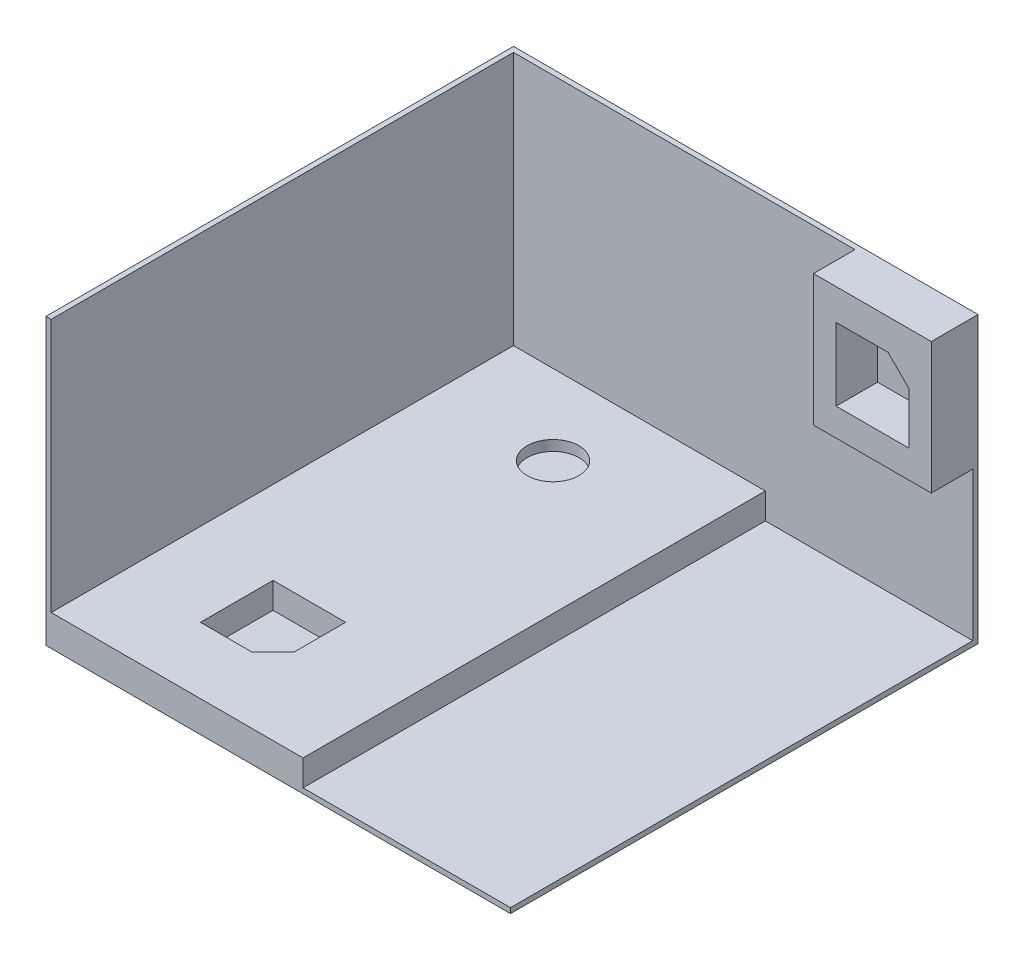
ISO-10303-21;
HEADER;
FILE_DESCRIPTION(('STEP AP214'),'2;1');
FILE_NAME('part.step','',(''),(''),'','','');
FILE_SCHEMA(('AUTOMOTIVE_DESIGN { 1 0 10303 214 1 1 1 1 }'));
ENDSEC;
DATA;
#1=APPLICATION_CONTEXT('core data for automotive mechanical design processes');
#2=APPLICATION_PROTOCOL_DEFINITION('international standard','automotive_design',2000,#1);
#3=PRODUCT_CONTEXT('',#1,'mechanical');
#4=PRODUCT('Part','Part','',(#3));
#5=PRODUCT_RELATED_PRODUCT_CATEGORY('part','',(#4));
#6=PRODUCT_DEFINITION_FORMATION('','',#4);
#7=PRODUCT_DEFINITION_CONTEXT('part definition',#1,'design');
#8=PRODUCT_DEFINITION('design','',#6,#7);
#9=PRODUCT_DEFINITION_SHAPE('','',#8);
#10=(LENGTH_UNIT() NAMED_UNIT(*) SI_UNIT(.MILLI.,.METRE.));
#11=(NAMED_UNIT(*) PLANE_ANGLE_UNIT() SI_UNIT($,.RADIAN.));
#12=(NAMED_UNIT(*) SI_UNIT($,.STERADIAN.) SOLID_ANGLE_UNIT());
#13=UNCERTAINTY_MEASURE_WITH_UNIT(LENGTH_MEASURE(1.E-05),#10,'distance_accuracy_value','');
#14=(GEOMETRIC_REPRESENTATION_CONTEXT(3) GLOBAL_UNCERTAINTY_ASSIGNED_CONTEXT((#13)) GLOBAL_UNIT_ASSIGNED_CONTEXT((#10,
#11,#12)) REPRESENTATION_CONTEXT('',''));
#15=CARTESIAN_POINT('',(0.,0.,0.));
#16=DIRECTION('',(0.,0.,1.));
#17=DIRECTION('',(1.,0.,0.));
#18=AXIS2_PLACEMENT_3D('',#15,#16,#17);
#19=CARTESIAN_POINT('',(0.,762.,-5597.22024855034));
#20=DIRECTION('',(0.,0.,-1.));
#21=DIRECTION('',(-1.,0.,0.));
#22=AXIS2_PLACEMENT_3D('',#19,#20,#21);
#23=PLANE('',#22);
#24=DIRECTION('',(0.,-1.,0.));
#25=VECTOR('',#24,1.);
#26=CARTESIAN_POINT('',(2804.13968,6981.20524,-5597.22024855034));
#27=LINE('',#26,#25);
#28=CARTESIAN_POINT('',(2804.13968,6981.20524,-5597.22024855034));
#29=VERTEX_POINT('',#28);
#30=CARTESIAN_POINT('',(2804.13968,3766.52536,-5597.22024855034));
#31=VERTEX_POINT('',#30);
#32=EDGE_CURVE('E203',#29,#31,#27,.T.);
#33=ORIENTED_EDGE('',*,*,#32,.F.);
#34=DIRECTION('',(1.,0.,0.));
#35=VECTOR('',#34,1.);
#36=CARTESIAN_POINT('',(0.,6981.20524,-5597.22024855034));
#37=LINE('',#36,#35);
#38=CARTESIAN_POINT('',(-5560.79914,6981.20524,-5597.22024855034));
#39=VERTEX_POINT('',#38);
#40=EDGE_CURVE('E266',#39,#29,#37,.T.);
#41=ORIENTED_EDGE('',*,*,#40,.F.);
#42=DIRECTION('',(0.,-1.,0.));
#43=VECTOR('',#42,1.);
#44=CARTESIAN_POINT('',(-5560.79914,6981.20524,-5597.22024855034));
#45=LINE('',#44,#43);
#46=CARTESIAN_POINT('',(-5560.79914,762.,-5597.22024855034));
#47=VERTEX_POINT('',#46);
#48=EDGE_CURVE('E271',#39,#47,#45,.T.);
#49=ORIENTED_EDGE('',*,*,#48,.T.);
#50=DIRECTION('',(-1.,0.,0.));
#51=VECTOR('',#50,1.);
#52=CARTESIAN_POINT('',(0.,762.,-5597.22024855034));
#53=LINE('',#52,#51);
#54=CARTESIAN_POINT('',(607.128580000001,762.,-5597.22024855034));
#55=VERTEX_POINT('',#54);
#56=EDGE_CURVE('E362',#55,#47,#53,.T.);
#57=ORIENTED_EDGE('',*,*,#56,.F.);
#58=DIRECTION('',(0.,-1.,0.));
#59=VECTOR('',#58,1.);
#60=CARTESIAN_POINT('',(607.12858,762.,-5597.22024855034));
#61=LINE('',#60,#59);
#62=CARTESIAN_POINT('',(607.12858,127.,-5597.22024855034));
#63=VERTEX_POINT('',#62);
#64=EDGE_CURVE('E303',#55,#63,#61,.T.);
#65=ORIENTED_EDGE('',*,*,#64,.T.);
#66=DIRECTION('',(-1.,0.,0.));
#67=VECTOR('',#66,1.);
#68=CARTESIAN_POINT('',(0.,127.,-5597.22024855034));
#69=LINE('',#68,#67);
#70=CARTESIAN_POINT('',(5687.79914,127.,-5597.22024855034));
#71=VERTEX_POINT('',#70);
#72=EDGE_CURVE('E323',#71,#63,#69,.T.);
#73=ORIENTED_EDGE('',*,*,#72,.F.);
#74=DIRECTION('',(0.,-1.,0.));
#75=VECTOR('',#74,1.);
#76=CARTESIAN_POINT('',(5687.79914,762.,-5597.22024855034));
#77=LINE('',#76,#75);
#78=CARTESIAN_POINT('',(5687.79914,3766.52536,-5597.22024855034));
#79=VERTEX_POINT('',#78);
#80=EDGE_CURVE('E317',#79,#71,#77,.T.);
#81=ORIENTED_EDGE('',*,*,#80,.F.);
#82=DIRECTION('',(1.,0.,0.));
#83=VECTOR('',#82,1.);
#84=CARTESIAN_POINT('',(5687.79914,3766.52536,-5597.22024855034));
#85=LINE('',#84,#83);
#86=EDGE_CURVE('E239',#31,#79,#85,.T.);
#87=ORIENTED_EDGE('',*,*,#86,.F.);
#88=EDGE_LOOP('',(#33,#41,#49,#57,#65,#73,#81,#87));
#89=FACE_BOUND('',#88,.T.);
#90=ADVANCED_FACE('F37',(#89),#23,.F.);
#91=CARTESIAN_POINT('',(0.,762.,0.));
#92=DIRECTION('',(0.,1.,0.));
#93=DIRECTION('',(0.,0.,1.));
#94=AXIS2_PLACEMENT_3D('',#91,#92,#93);
#95=PLANE('',#94);
#96=CARTESIAN_POINT('',(-2636.77654,762.,-3641.79739));
#97=DIRECTION('',(0.,1.,0.));
#98=DIRECTION('',(0.,0.,1.));
#99=AXIS2_PLACEMENT_3D('',#96,#97,#98);
#100=CIRCLE('',#99,635.);
#101=CARTESIAN_POINT('',(-2636.77654,762.,-3006.79739));
#102=VERTEX_POINT('',#101);
#103=EDGE_CURVE('E282',#102,#102,#100,.T.);
#104=ORIENTED_EDGE('',*,*,#103,.F.);
#105=EDGE_LOOP('',(#104));
#106=FACE_BOUND('',#105,.T.);
#107=DIRECTION('',(1.,0.,0.));
#108=VECTOR('',#107,1.);
#109=CARTESIAN_POINT('',(0.,762.,2327.20261));
#110=LINE('',#109,#108);
#111=CARTESIAN_POINT('',(-3525.77654,762.,2327.20261));
#112=VERTEX_POINT('',#111);
#113=CARTESIAN_POINT('',(-1747.77654,762.,2327.20261));
#114=VERTEX_POINT('',#113);
#115=EDGE_CURVE('E285',#112,#114,#110,.T.);
#116=ORIENTED_EDGE('',*,*,#115,.T.);
#117=DIRECTION('',(0.,0.,1.));
#118=VECTOR('',#117,1.);
#119=CARTESIAN_POINT('',(-1747.77654,762.,0.));
#120=LINE('',#119,#118);
#121=CARTESIAN_POINT('',(-1747.77654,762.,3597.20261));
#122=VERTEX_POINT('',#121);
#123=EDGE_CURVE('E288',#114,#122,#120,.T.);
#124=ORIENTED_EDGE('',*,*,#123,.T.);
#125=DIRECTION('',(-0.707106781186549,0.,0.707106781186547));
#126=VECTOR('',#125,1.);
#127=CARTESIAN_POINT('',(924.713035000003,762.,924.713035000006));
#128=LINE('',#127,#126);
#129=CARTESIAN_POINT('',(-2255.77654,762.,4105.20261));
#130=VERTEX_POINT('',#129);
#131=EDGE_CURVE('E290',#122,#130,#128,.T.);
#132=ORIENTED_EDGE('',*,*,#131,.T.);
#133=DIRECTION('',(1.,0.,0.));
#134=VECTOR('',#133,1.);
#135=CARTESIAN_POINT('',(2.87098611551073E-12,762.,4105.20261));
#136=LINE('',#135,#134);
#137=CARTESIAN_POINT('',(-3525.77654,762.,4105.20261));
#138=VERTEX_POINT('',#137);
#139=EDGE_CURVE('E292',#138,#130,#136,.T.);
#140=ORIENTED_EDGE('',*,*,#139,.F.);
#141=DIRECTION('',(0.,0.,1.));
#142=VECTOR('',#141,1.);
#143=CARTESIAN_POINT('',(-3525.77654,762.,0.));
#144=LINE('',#143,#142);
#145=EDGE_CURVE('E295',#112,#138,#144,.T.);
#146=ORIENTED_EDGE('',*,*,#145,.F.);
#147=EDGE_LOOP('',(#116,#124,#132,#140,#146));
#148=FACE_BOUND('',#147,.T.);
#149=ORIENTED_EDGE('',*,*,#56,.T.);
#150=DIRECTION('',(0.,0.,1.));
#151=VECTOR('',#150,1.);
#152=CARTESIAN_POINT('',(-5560.79914,762.,-4.362182486167E-13));
#153=LINE('',#152,#151);
#154=CARTESIAN_POINT('',(-5560.79914,762.,5725.05205));
#155=VERTEX_POINT('',#154);
#156=EDGE_CURVE('E45',#47,#155,#153,.T.);
#157=ORIENTED_EDGE('',*,*,#156,.T.);
#158=DIRECTION('',(-1.,0.,0.));
#159=VECTOR('',#158,1.);
#160=CARTESIAN_POINT('',(8.93995648810827E-13,762.,5725.05205));
#161=LINE('',#160,#159);
#162=CARTESIAN_POINT('',(607.128580000002,762.,5725.05205));
#163=VERTEX_POINT('',#162);
#164=EDGE_CURVE('E279',#163,#155,#161,.T.);
#165=ORIENTED_EDGE('',*,*,#164,.F.);
#166=DIRECTION('',(0.,0.,1.));
#167=VECTOR('',#166,1.);
#168=CARTESIAN_POINT('',(607.128580000001,762.,-1.17736593927382E-13));
#169=LINE('',#168,#167);
#170=EDGE_CURVE('E276',#55,#163,#169,.T.);
#171=ORIENTED_EDGE('',*,*,#170,.F.);
#172=EDGE_LOOP('',(#149,#157,#165,#171));
#173=FACE_BOUND('',#172,.T.);
#174=ADVANCED_FACE('F367',(#106,#148,#173),#95,.T.);
#175=CARTESIAN_POINT('',(0.,127.,0.));
#176=DIRECTION('',(0.,1.,0.));
#177=DIRECTION('',(0.,0.,1.));
#178=AXIS2_PLACEMENT_3D('',#175,#176,#177);
#179=PLANE('',#178);
#180=DIRECTION('',(0.,0.,-1.));
#181=VECTOR('',#180,1.);
#182=CARTESIAN_POINT('',(607.128580000001,127.,-1.17736593927382E-13));
#183=LINE('',#182,#181);
#184=CARTESIAN_POINT('',(607.128580000002,127.,5725.05205));
#185=VERTEX_POINT('',#184);
#186=EDGE_CURVE('E326',#185,#63,#183,.T.);
#187=ORIENTED_EDGE('',*,*,#186,.F.);
#188=DIRECTION('',(-1.,0.,0.));
#189=VECTOR('',#188,1.);
#190=CARTESIAN_POINT('',(8.93995648810827E-13,127.,5725.05205));
#191=LINE('',#190,#189);
#192=CARTESIAN_POINT('',(5687.79914,127.,5725.05205));
#193=VERTEX_POINT('',#192);
#194=EDGE_CURVE('E337',#193,#185,#191,.T.);
#195=ORIENTED_EDGE('',*,*,#194,.F.);
#196=DIRECTION('',(0.,0.,1.));
#197=VECTOR('',#196,1.);
#198=CARTESIAN_POINT('',(5687.79914,127.,-8.82399043295498E-13));
#199=LINE('',#198,#197);
#200=EDGE_CURVE('E340',#71,#193,#199,.T.);
#201=ORIENTED_EDGE('',*,*,#200,.F.);
#202=ORIENTED_EDGE('',*,*,#72,.T.);
#203=EDGE_LOOP('',(#187,#195,#201,#202));
#204=FACE_BOUND('',#203,.T.);
#205=ADVANCED_FACE('F386',(#204),#179,.T.);
#206=CARTESIAN_POINT('',(-1.34099347321624E-12,127.,-5725.05205));
#207=DIRECTION('',(0.,0.,1.));
#208=DIRECTION('',(1.,0.,0.));
#209=AXIS2_PLACEMENT_3D('',#206,#207,#208);
#210=PLANE('',#209);
#211=DIRECTION('',(-1.,0.,0.));
#212=VECTOR('',#211,1.);
#213=CARTESIAN_POINT('',(-1.34099347321624E-12,0.,-5725.05205));
#214=LINE('',#213,#212);
#215=CARTESIAN_POINT('',(5687.79914,0.,-5725.05205));
#216=VERTEX_POINT('',#215);
#217=CARTESIAN_POINT('',(-5687.79914,0.,-5725.05205));
#218=VERTEX_POINT('',#217);
#219=EDGE_CURVE('E336',#216,#218,#214,.T.);
#220=ORIENTED_EDGE('',*,*,#219,.T.);
#221=DIRECTION('',(0.,-1.,0.));
#222=VECTOR('',#221,1.);
#223=CARTESIAN_POINT('',(-5687.79914,127.,-5725.05205));
#224=LINE('',#223,#222);
#225=CARTESIAN_POINT('',(-5687.79914,6981.20524,-5725.05205));
#226=VERTEX_POINT('',#225);
#227=EDGE_CURVE('E359',#226,#218,#224,.T.);
#228=ORIENTED_EDGE('',*,*,#227,.F.);
#229=DIRECTION('',(-1.,0.,0.));
#230=VECTOR('',#229,1.);
#231=CARTESIAN_POINT('',(-1.34099347321624E-12,6981.20524,-5725.05205));
#232=LINE('',#231,#230);
#233=CARTESIAN_POINT('',(5687.79914,6981.20524,-5725.05205));
#234=VERTEX_POINT('',#233);
#235=EDGE_CURVE('E255',#234,#226,#232,.T.);
#236=ORIENTED_EDGE('',*,*,#235,.F.);
#237=DIRECTION('',(0.,-1.,0.));
#238=VECTOR('',#237,1.);
#239=CARTESIAN_POINT('',(5687.79914,127.,-5725.05205));
#240=LINE('',#239,#238);
#241=EDGE_CURVE('E343',#234,#216,#240,.T.);
#242=ORIENTED_EDGE('',*,*,#241,.T.);
#243=EDGE_LOOP('',(#220,#228,#236,#242));
#244=FACE_BOUND('',#243,.T.);
#245=ADVANCED_FACE('F39',(#244),#210,.F.);
#246=CARTESIAN_POINT('',(-5687.79914,127.,8.82399043295498E-13));
#247=DIRECTION('',(1.,0.,0.));
#248=DIRECTION('',(0.,0.,-1.));
#249=AXIS2_PLACEMENT_3D('',#246,#247,#248);
#250=PLANE('',#249);
#251=DIRECTION('',(0.,0.,1.));
#252=VECTOR('',#251,1.);
#253=CARTESIAN_POINT('',(-5687.79914,0.,8.82399043295498E-13));
#254=LINE('',#253,#252);
#255=CARTESIAN_POINT('',(-5687.79914,0.,5725.05205));
#256=VERTEX_POINT('',#255);
#257=EDGE_CURVE('E346',#218,#256,#254,.T.);
#258=ORIENTED_EDGE('',*,*,#257,.T.);
#259=DIRECTION('',(0.,-1.,0.));
#260=VECTOR('',#259,1.);
#261=CARTESIAN_POINT('',(-5687.79914,127.,5725.05205));
#262=LINE('',#261,#260);
#263=CARTESIAN_POINT('',(-5687.79914,6981.20524,5725.05205));
#264=VERTEX_POINT('',#263);
#265=EDGE_CURVE('E356',#264,#256,#262,.T.);
#266=ORIENTED_EDGE('',*,*,#265,.F.);
#267=DIRECTION('',(0.,0.,1.));
#268=VECTOR('',#267,1.);
#269=CARTESIAN_POINT('',(-5687.79914,6981.20524,8.82399043295498E-13));
#270=LINE('',#269,#268);
#271=EDGE_CURVE('E258',#226,#264,#270,.T.);
#272=ORIENTED_EDGE('',*,*,#271,.F.);
#273=ORIENTED_EDGE('',*,*,#227,.T.);
#274=EDGE_LOOP('',(#258,#266,#272,#273));
#275=FACE_BOUND('',#274,.T.);
#276=ADVANCED_FACE('F667',(#275),#250,.F.);
#277=CARTESIAN_POINT('',(8.93995648810827E-13,127.,5725.05205));
#278=DIRECTION('',(0.,0.,1.));
#279=DIRECTION('',(1.,0.,0.));
#280=AXIS2_PLACEMENT_3D('',#277,#278,#279);
#281=PLANE('',#280);
#282=ORIENTED_EDGE('',*,*,#265,.T.);
#283=DIRECTION('',(-1.,0.,0.));
#284=VECTOR('',#283,1.);
#285=CARTESIAN_POINT('',(8.93995648810827E-13,0.,5725.05205));
#286=LINE('',#285,#284);
#287=CARTESIAN_POINT('',(5687.79914,0.,5725.05205));
#288=VERTEX_POINT('',#287);
#289=EDGE_CURVE('E349',#288,#256,#286,.T.);
#290=ORIENTED_EDGE('',*,*,#289,.F.);
#291=DIRECTION('',(0.,-1.,0.));
#292=VECTOR('',#291,1.);
#293=CARTESIAN_POINT('',(5687.79914,127.,5725.05205));
#294=LINE('',#293,#292);
#295=EDGE_CURVE('E353',#193,#288,#294,.T.);
#296=ORIENTED_EDGE('',*,*,#295,.F.);
#297=ORIENTED_EDGE('',*,*,#194,.T.);
#298=DIRECTION('',(0.,-1.,0.));
#299=VECTOR('',#298,1.);
#300=CARTESIAN_POINT('',(607.128580000002,762.,5725.05205));
#301=LINE('',#300,#299);
#302=EDGE_CURVE('E298',#163,#185,#301,.T.);
#303=ORIENTED_EDGE('',*,*,#302,.F.);
#304=ORIENTED_EDGE('',*,*,#164,.T.);
#305=DIRECTION('',(0.,-1.,0.));
#306=VECTOR('',#305,1.);
#307=CARTESIAN_POINT('',(-5560.79914,6981.20524,5725.05205));
#308=LINE('',#307,#306);
#309=CARTESIAN_POINT('',(-5560.79914,6981.20524,5725.05205));
#310=VERTEX_POINT('',#309);
#311=EDGE_CURVE('E274',#310,#155,#308,.T.);
#312=ORIENTED_EDGE('',*,*,#311,.F.);
#313=DIRECTION('',(-1.,0.,0.));
#314=VECTOR('',#313,1.);
#315=CARTESIAN_POINT('',(8.93995648810827E-13,6981.20524,5725.05205));
#316=LINE('',#315,#314);
#317=EDGE_CURVE('E261',#310,#264,#316,.T.);
#318=ORIENTED_EDGE('',*,*,#317,.T.);
#319=EDGE_LOOP('',(#282,#290,#296,#297,#303,#304,#312,#318));
#320=FACE_BOUND('',#319,.T.);
#321=ADVANCED_FACE('F372',(#320),#281,.T.);
#322=CARTESIAN_POINT('',(5687.79914,127.,-8.82399043295498E-13));
#323=DIRECTION('',(1.,0.,0.));
#324=DIRECTION('',(0.,0.,-1.));
#325=AXIS2_PLACEMENT_3D('',#322,#323,#324);
#326=PLANE('',#325);
#327=DIRECTION('',(0.,0.,1.));
#328=VECTOR('',#327,1.);
#329=CARTESIAN_POINT('',(5687.79914,6981.20524,-8.82399043295498E-13));
#330=LINE('',#329,#328);
#331=CARTESIAN_POINT('',(5687.79914,6981.20524,-4581.22024855034));
#332=VERTEX_POINT('',#331);
#333=EDGE_CURVE('E269',#234,#332,#330,.T.);
#334=ORIENTED_EDGE('',*,*,#333,.T.);
#335=DIRECTION('',(0.,1.,0.));
#336=VECTOR('',#335,1.);
#337=CARTESIAN_POINT('',(5687.79914,6981.20524,-4581.22024855034));
#338=LINE('',#337,#336);
#339=CARTESIAN_POINT('',(5687.79914,3766.52536,-4581.22024855034));
#340=VERTEX_POINT('',#339);
#341=EDGE_CURVE('E235',#340,#332,#338,.T.);
#342=ORIENTED_EDGE('',*,*,#341,.F.);
#343=DIRECTION('',(0.,0.,-1.));
#344=VECTOR('',#343,1.);
#345=CARTESIAN_POINT('',(5687.79914,3766.52536,-4581.22024855034));
#346=LINE('',#345,#344);
#347=EDGE_CURVE('E245',#340,#79,#346,.T.);
#348=ORIENTED_EDGE('',*,*,#347,.T.);
#349=ORIENTED_EDGE('',*,*,#80,.T.);
#350=ORIENTED_EDGE('',*,*,#200,.T.);
#351=ORIENTED_EDGE('',*,*,#295,.T.);
#352=DIRECTION('',(0.,0.,1.));
#353=VECTOR('',#352,1.);
#354=CARTESIAN_POINT('',(5687.79914,0.,-8.82399043295498E-13));
#355=LINE('',#354,#353);
#356=EDGE_CURVE('E341',#216,#288,#355,.T.);
#357=ORIENTED_EDGE('',*,*,#356,.F.);
#358=ORIENTED_EDGE('',*,*,#241,.F.);
#359=EDGE_LOOP('',(#334,#342,#348,#349,#350,#351,#357,#358));
#360=FACE_BOUND('',#359,.T.);
#361=ADVANCED_FACE('F388',(#360),#326,.T.);
#362=CARTESIAN_POINT('',(0.,0.,0.));
#363=DIRECTION('',(0.,1.,0.));
#364=DIRECTION('',(0.,0.,1.));
#365=AXIS2_PLACEMENT_3D('',#362,#363,#364);
#366=PLANE('',#365);
#367=ORIENTED_EDGE('',*,*,#289,.T.);
#368=ORIENTED_EDGE('',*,*,#257,.F.);
#369=ORIENTED_EDGE('',*,*,#219,.F.);
#370=ORIENTED_EDGE('',*,*,#356,.T.);
#371=EDGE_LOOP('',(#367,#368,#369,#370));
#372=FACE_BOUND('',#371,.T.);
#373=ADVANCED_FACE('F392',(#372),#366,.F.);
#374=CARTESIAN_POINT('',(0.,762.,2327.20261));
#375=DIRECTION('',(0.,0.,-1.));
#376=DIRECTION('',(-1.,0.,0.));
#377=AXIS2_PLACEMENT_3D('',#374,#375,#376);
#378=PLANE('',#377);
#379=DIRECTION('',(-1.,0.,0.));
#380=VECTOR('',#379,1.);
#381=CARTESIAN_POINT('',(0.,127.,2327.20261));
#382=LINE('',#381,#380);
#383=CARTESIAN_POINT('',(-1747.77654,127.,2327.20261));
#384=VERTEX_POINT('',#383);
#385=CARTESIAN_POINT('',(-3525.77654,127.,2327.20261));
#386=VERTEX_POINT('',#385);
#387=EDGE_CURVE('E334',#384,#386,#382,.T.);
#388=ORIENTED_EDGE('',*,*,#387,.F.);
#389=DIRECTION('',(0.,-1.,0.));
#390=VECTOR('',#389,1.);
#391=CARTESIAN_POINT('',(-1747.77654,762.,2327.20261));
#392=LINE('',#391,#390);
#393=EDGE_CURVE('E312',#114,#384,#392,.T.);
#394=ORIENTED_EDGE('',*,*,#393,.F.);
#395=ORIENTED_EDGE('',*,*,#115,.F.);
#396=DIRECTION('',(0.,-1.,0.));
#397=VECTOR('',#396,1.);
#398=CARTESIAN_POINT('',(-3525.77654,762.,2327.20261));
#399=LINE('',#398,#397);
#400=EDGE_CURVE('E299',#112,#386,#399,.T.);
#401=ORIENTED_EDGE('',*,*,#400,.T.);
#402=EDGE_LOOP('',(#388,#394,#395,#401));
#403=FACE_BOUND('',#402,.T.);
#404=ADVANCED_FACE('F613',(#403),#378,.F.);
#405=CARTESIAN_POINT('',(-1747.77654,762.,0.));
#406=DIRECTION('',(1.,0.,0.));
#407=DIRECTION('',(0.,0.,-1.));
#408=AXIS2_PLACEMENT_3D('',#405,#406,#407);
#409=PLANE('',#408);
#410=DIRECTION('',(0.,0.,-1.));
#411=VECTOR('',#410,1.);
#412=CARTESIAN_POINT('',(-1747.77654,127.,0.));
#413=LINE('',#412,#411);
#414=CARTESIAN_POINT('',(-1747.77654,127.,3597.20261));
#415=VERTEX_POINT('',#414);
#416=EDGE_CURVE('E60',#415,#384,#413,.T.);
#417=ORIENTED_EDGE('',*,*,#416,.F.);
#418=DIRECTION('',(0.,-1.,0.));
#419=VECTOR('',#418,1.);
#420=CARTESIAN_POINT('',(-1747.77654,762.,3597.20261));
#421=LINE('',#420,#419);
#422=EDGE_CURVE('E309',#122,#415,#421,.T.);
#423=ORIENTED_EDGE('',*,*,#422,.F.);
#424=ORIENTED_EDGE('',*,*,#123,.F.);
#425=ORIENTED_EDGE('',*,*,#393,.T.);
#426=EDGE_LOOP('',(#417,#423,#424,#425));
#427=FACE_BOUND('',#426,.T.);
#428=ADVANCED_FACE('F605',(#427),#409,.F.);
#429=CARTESIAN_POINT('',(924.713035000003,762.,924.713035000006));
#430=DIRECTION('',(0.707106781186547,0.,0.707106781186549));
#431=DIRECTION('',(0.707106781186549,0.,-0.707106781186547));
#432=AXIS2_PLACEMENT_3D('',#429,#430,#431);
#433=PLANE('',#432);
#434=DIRECTION('',(0.707106781186549,0.,-0.707106781186547));
#435=VECTOR('',#434,1.);
#436=CARTESIAN_POINT('',(924.713035000004,127.,924.713035000006));
#437=LINE('',#436,#435);
#438=CARTESIAN_POINT('',(-2255.77654,127.,4105.20261));
#439=VERTEX_POINT('',#438);
#440=EDGE_CURVE('E331',#439,#415,#437,.T.);
#441=ORIENTED_EDGE('',*,*,#440,.F.);
#442=DIRECTION('',(0.,-1.,0.));
#443=VECTOR('',#442,1.);
#444=CARTESIAN_POINT('',(-2255.77654,762.,4105.20261));
#445=LINE('',#444,#443);
#446=EDGE_CURVE('E306',#130,#439,#445,.T.);
#447=ORIENTED_EDGE('',*,*,#446,.F.);
#448=ORIENTED_EDGE('',*,*,#131,.F.);
#449=ORIENTED_EDGE('',*,*,#422,.T.);
#450=EDGE_LOOP('',(#441,#447,#448,#449));
#451=FACE_BOUND('',#450,.T.);
#452=ADVANCED_FACE('F597',(#451),#433,.F.);
#453=CARTESIAN_POINT('',(2.87098611551073E-12,762.,4105.20261));
#454=DIRECTION('',(0.,0.,-1.));
#455=DIRECTION('',(-1.,0.,0.));
#456=AXIS2_PLACEMENT_3D('',#453,#454,#455);
#457=PLANE('',#456);
#458=ORIENTED_EDGE('',*,*,#446,.T.);
#459=DIRECTION('',(-1.,0.,0.));
#460=VECTOR('',#459,1.);
#461=CARTESIAN_POINT('',(2.87098611551073E-12,127.,4105.20261));
#462=LINE('',#461,#460);
#463=CARTESIAN_POINT('',(-3525.77654,127.,4105.20261));
#464=VERTEX_POINT('',#463);
#465=EDGE_CURVE('E328',#439,#464,#462,.T.);
#466=ORIENTED_EDGE('',*,*,#465,.T.);
#467=DIRECTION('',(0.,-1.,0.));
#468=VECTOR('',#467,1.);
#469=CARTESIAN_POINT('',(-3525.77654,762.,4105.20261));
#470=LINE('',#469,#468);
#471=EDGE_CURVE('E302',#138,#464,#470,.T.);
#472=ORIENTED_EDGE('',*,*,#471,.F.);
#473=ORIENTED_EDGE('',*,*,#139,.T.);
#474=EDGE_LOOP('',(#458,#466,#472,#473));
#475=FACE_BOUND('',#474,.T.);
#476=ADVANCED_FACE('F592',(#475),#457,.T.);
#477=CARTESIAN_POINT('',(607.128580000001,762.,-1.17736593927382E-13));
#478=DIRECTION('',(1.,0.,0.));
#479=DIRECTION('',(0.,0.,-1.));
#480=AXIS2_PLACEMENT_3D('',#477,#478,#479);
#481=PLANE('',#480);
#482=ORIENTED_EDGE('',*,*,#302,.T.);
#483=ORIENTED_EDGE('',*,*,#186,.T.);
#484=ORIENTED_EDGE('',*,*,#64,.F.);
#485=ORIENTED_EDGE('',*,*,#170,.T.);
#486=EDGE_LOOP('',(#482,#483,#484,#485));
#487=FACE_BOUND('',#486,.T.);
#488=ADVANCED_FACE('F379',(#487),#481,.T.);
#489=CARTESIAN_POINT('',(-2636.77654,762.,-3641.79739));
#490=DIRECTION('',(0.,-1.,0.));
#491=DIRECTION('',(0.,0.,-1.));
#492=AXIS2_PLACEMENT_3D('',#489,#490,#491);
#493=CYLINDRICAL_SURFACE('',#492,635.);
#494=CARTESIAN_POINT('',(-2636.77654,508.,-3641.79739));
#495=DIRECTION('',(0.,1.,0.));
#496=DIRECTION('',(0.,0.,1.));
#497=AXIS2_PLACEMENT_3D('',#494,#495,#496);
#498=CIRCLE('',#497,635.);
#499=CARTESIAN_POINT('',(-2636.77654,508.,-3006.79739));
#500=VERTEX_POINT('',#499);
#501=EDGE_CURVE('E12',#500,#500,#498,.T.);
#502=ORIENTED_EDGE('',*,*,#501,.F.);
#503=EDGE_LOOP('',(#502));
#504=FACE_BOUND('',#503,.T.);
#505=ORIENTED_EDGE('',*,*,#103,.T.);
#506=EDGE_LOOP('',(#505));
#507=FACE_BOUND('',#506,.T.);
#508=ADVANCED_FACE('F580',(#504,#507),#493,.F.);
#509=CARTESIAN_POINT('',(-3525.77654,762.,0.));
#510=DIRECTION('',(1.,0.,0.));
#511=DIRECTION('',(0.,0.,-1.));
#512=AXIS2_PLACEMENT_3D('',#509,#510,#511);
#513=PLANE('',#512);
#514=ORIENTED_EDGE('',*,*,#471,.T.);
#515=DIRECTION('',(0.,0.,-1.));
#516=VECTOR('',#515,1.);
#517=CARTESIAN_POINT('',(-3525.77654,127.,0.));
#518=LINE('',#517,#516);
#519=EDGE_CURVE('E315',#464,#386,#518,.T.);
#520=ORIENTED_EDGE('',*,*,#519,.T.);
#521=ORIENTED_EDGE('',*,*,#400,.F.);
#522=ORIENTED_EDGE('',*,*,#145,.T.);
#523=EDGE_LOOP('',(#514,#520,#521,#522));
#524=FACE_BOUND('',#523,.T.);
#525=ADVANCED_FACE('F572',(#524),#513,.T.);
#526=ORIENTED_EDGE('',*,*,#416,.T.);
#527=ORIENTED_EDGE('',*,*,#387,.T.);
#528=ORIENTED_EDGE('',*,*,#519,.F.);
#529=ORIENTED_EDGE('',*,*,#465,.F.);
#530=ORIENTED_EDGE('',*,*,#440,.T.);
#531=EDGE_LOOP('',(#526,#527,#528,#529,#530));
#532=FACE_BOUND('',#531,.T.);
#533=ADVANCED_FACE('F508',(#532),#179,.T.);
#534=CARTESIAN_POINT('',(-5560.79914,6981.20524,-4.362182486167E-13));
#535=DIRECTION('',(-1.,0.,0.));
#536=DIRECTION('',(0.,0.,1.));
#537=AXIS2_PLACEMENT_3D('',#534,#535,#536);
#538=PLANE('',#537);
#539=ORIENTED_EDGE('',*,*,#156,.F.);
#540=ORIENTED_EDGE('',*,*,#48,.F.);
#541=DIRECTION('',(0.,0.,-1.));
#542=VECTOR('',#541,1.);
#543=CARTESIAN_POINT('',(-5560.79914,6981.20524,-4.362182486167E-13));
#544=LINE('',#543,#542);
#545=EDGE_CURVE('E264',#310,#39,#544,.T.);
#546=ORIENTED_EDGE('',*,*,#545,.F.);
#547=ORIENTED_EDGE('',*,*,#311,.T.);
#548=EDGE_LOOP('',(#539,#540,#546,#547));
#549=FACE_BOUND('',#548,.T.);
#550=ADVANCED_FACE('F502',(#549),#538,.F.);
#551=CARTESIAN_POINT('',(0.,6981.20524,0.));
#552=DIRECTION('',(0.,1.,0.));
#553=DIRECTION('',(0.,0.,1.));
#554=AXIS2_PLACEMENT_3D('',#551,#552,#553);
#555=PLANE('',#554);
#556=ORIENTED_EDGE('',*,*,#235,.T.);
#557=ORIENTED_EDGE('',*,*,#271,.T.);
#558=ORIENTED_EDGE('',*,*,#317,.F.);
#559=ORIENTED_EDGE('',*,*,#545,.T.);
#560=ORIENTED_EDGE('',*,*,#40,.T.);
#561=DIRECTION('',(0.,0.,-1.));
#562=VECTOR('',#561,1.);
#563=CARTESIAN_POINT('',(2804.13968,6981.20524,-4581.22024855034));
#564=LINE('',#563,#562);
#565=CARTESIAN_POINT('',(2804.13968,6981.20524,-4581.22024855034));
#566=VERTEX_POINT('',#565);
#567=EDGE_CURVE('E253',#566,#29,#564,.T.);
#568=ORIENTED_EDGE('',*,*,#567,.F.);
#569=DIRECTION('',(-1.,0.,0.));
#570=VECTOR('',#569,1.);
#571=CARTESIAN_POINT('',(5687.79914,6981.20524,-4581.22024855034));
#572=LINE('',#571,#570);
#573=EDGE_CURVE('E238',#332,#566,#572,.T.);
#574=ORIENTED_EDGE('',*,*,#573,.F.);
#575=ORIENTED_EDGE('',*,*,#333,.F.);
#576=EDGE_LOOP('',(#556,#557,#558,#559,#560,#568,#574,#575));
#577=FACE_BOUND('',#576,.T.);
#578=ADVANCED_FACE('F401',(#577),#555,.T.);
#579=CARTESIAN_POINT('',(0.,508.,0.));
#580=DIRECTION('',(0.,1.,0.));
#581=DIRECTION('',(0.,0.,1.));
#582=AXIS2_PLACEMENT_3D('',#579,#580,#581);
#583=PLANE('',#582);
#584=ORIENTED_EDGE('',*,*,#501,.T.);
#585=EDGE_LOOP('',(#584));
#586=FACE_BOUND('',#585,.T.);
#587=ADVANCED_FACE('F421',(#586),#583,.T.);
#588=CARTESIAN_POINT('',(0.,0.,-4581.22024855034));
#589=DIRECTION('',(0.,0.,-1.));
#590=DIRECTION('',(-1.,0.,0.));
#591=AXIS2_PLACEMENT_3D('',#588,#589,#590);
#592=PLANE('',#591);
#593=ORIENTED_EDGE('',*,*,#341,.T.);
#594=ORIENTED_EDGE('',*,*,#573,.T.);
#595=DIRECTION('',(0.,-1.,0.));
#596=VECTOR('',#595,1.);
#597=CARTESIAN_POINT('',(2804.13968,6981.20524,-4581.22024855034));
#598=LINE('',#597,#596);
#599=CARTESIAN_POINT('',(2804.13968,3766.52536,-4581.22024855034));
#600=VERTEX_POINT('',#599);
#601=EDGE_CURVE('E241',#566,#600,#598,.T.);
#602=ORIENTED_EDGE('',*,*,#601,.T.);
#603=DIRECTION('',(1.,0.,0.));
#604=VECTOR('',#603,1.);
#605=CARTESIAN_POINT('',(5687.79914,3766.52536,-4581.22024855034));
#606=LINE('',#605,#604);
#607=EDGE_CURVE('E243',#600,#340,#606,.T.);
#608=ORIENTED_EDGE('',*,*,#607,.T.);
#609=EDGE_LOOP('',(#593,#594,#602,#608));
#610=FACE_BOUND('',#609,.T.);
#611=DIRECTION('',(0.,-1.,0.));
#612=VECTOR('',#611,1.);
#613=CARTESIAN_POINT('',(3357.62346,4445.,-4581.22024855034));
#614=LINE('',#613,#612);
#615=CARTESIAN_POINT('',(3357.62346,6223.,-4581.22024855034));
#616=VERTEX_POINT('',#615);
#617=CARTESIAN_POINT('',(3357.62346,4445.,-4581.22024855034));
#618=VERTEX_POINT('',#617);
#619=EDGE_CURVE('E187',#616,#618,#614,.T.);
#620=ORIENTED_EDGE('',*,*,#619,.F.);
#621=DIRECTION('',(-1.,0.,0.));
#622=VECTOR('',#621,1.);
#623=CARTESIAN_POINT('',(4627.62346,6223.,-4581.22024855034));
#624=LINE('',#623,#622);
#625=CARTESIAN_POINT('',(4627.62346,6223.,-4581.22024855034));
#626=VERTEX_POINT('',#625);
#627=EDGE_CURVE('E216',#626,#616,#624,.T.);
#628=ORIENTED_EDGE('',*,*,#627,.F.);
#629=DIRECTION('',(-0.707106781186547,0.707106781186548,0.));
#630=VECTOR('',#629,1.);
#631=CARTESIAN_POINT('',(4627.62346,6223.,-4581.22024855034));
#632=LINE('',#631,#630);
#633=CARTESIAN_POINT('',(5135.62346,5715.,-4581.22024855034));
#634=VERTEX_POINT('',#633);
#635=EDGE_CURVE('E211',#634,#626,#632,.T.);
#636=ORIENTED_EDGE('',*,*,#635,.F.);
#637=DIRECTION('',(0.,1.,0.));
#638=VECTOR('',#637,1.);
#639=CARTESIAN_POINT('',(5135.62346,4445.,-4581.22024855034));
#640=LINE('',#639,#638);
#641=CARTESIAN_POINT('',(5135.62346,4445.,-4581.22024855034));
#642=VERTEX_POINT('',#641);
#643=EDGE_CURVE('E209',#642,#634,#640,.T.);
#644=ORIENTED_EDGE('',*,*,#643,.F.);
#645=DIRECTION('',(1.,0.,0.));
#646=VECTOR('',#645,1.);
#647=CARTESIAN_POINT('',(5135.62346,4445.,-4581.22024855034));
#648=LINE('',#647,#646);
#649=EDGE_CURVE('E195',#618,#642,#648,.T.);
#650=ORIENTED_EDGE('',*,*,#649,.F.);
#651=EDGE_LOOP('',(#620,#628,#636,#644,#650));
#652=FACE_BOUND('',#651,.T.);
#653=ADVANCED_FACE('F207',(#610,#652),#592,.F.);
#654=CARTESIAN_POINT('',(2804.13968,6981.20524,-4581.22024855034));
#655=DIRECTION('',(1.,0.,0.));
#656=DIRECTION('',(0.,1.,0.));
#657=AXIS2_PLACEMENT_3D('',#654,#655,#656);
#658=PLANE('',#657);
#659=ORIENTED_EDGE('',*,*,#32,.T.);
#660=DIRECTION('',(0.,0.,-1.));
#661=VECTOR('',#660,1.);
#662=CARTESIAN_POINT('',(2804.13968,3766.52536,-4581.22024855034));
#663=LINE('',#662,#661);
#664=EDGE_CURVE('E250',#600,#31,#663,.T.);
#665=ORIENTED_EDGE('',*,*,#664,.F.);
#666=ORIENTED_EDGE('',*,*,#601,.F.);
#667=ORIENTED_EDGE('',*,*,#567,.T.);
#668=EDGE_LOOP('',(#659,#665,#666,#667));
#669=FACE_BOUND('',#668,.T.);
#670=ADVANCED_FACE('F413',(#669),#658,.F.);
#671=CARTESIAN_POINT('',(5687.79914,3766.52536,-4581.22024855034));
#672=DIRECTION('',(0.,1.,0.));
#673=DIRECTION('',(-1.,0.,0.));
#674=AXIS2_PLACEMENT_3D('',#671,#672,#673);
#675=PLANE('',#674);
#676=ORIENTED_EDGE('',*,*,#86,.T.);
#677=ORIENTED_EDGE('',*,*,#347,.F.);
#678=ORIENTED_EDGE('',*,*,#607,.F.);
#679=ORIENTED_EDGE('',*,*,#664,.T.);
#680=EDGE_LOOP('',(#676,#677,#678,#679));
#681=FACE_BOUND('',#680,.T.);
#682=ADVANCED_FACE('F410',(#681),#675,.F.);
#683=CARTESIAN_POINT('',(3357.62346,4445.,-4581.22024855034));
#684=DIRECTION('',(1.,0.,0.));
#685=DIRECTION('',(0.,1.,0.));
#686=AXIS2_PLACEMENT_3D('',#683,#684,#685);
#687=PLANE('',#686);
#688=DIRECTION('',(0.,-1.,0.));
#689=VECTOR('',#688,1.);
#690=CARTESIAN_POINT('',(3357.62346,4445.,-5597.22024855034));
#691=LINE('',#690,#689);
#692=CARTESIAN_POINT('',(3357.62346,6223.,-5597.22024855034));
#693=VERTEX_POINT('',#692);
#694=CARTESIAN_POINT('',(3357.62346,4445.,-5597.22024855034));
#695=VERTEX_POINT('',#694);
#696=EDGE_CURVE('E218',#693,#695,#691,.T.);
#697=ORIENTED_EDGE('',*,*,#696,.F.);
#698=DIRECTION('',(0.,0.,-1.));
#699=VECTOR('',#698,1.);
#700=CARTESIAN_POINT('',(3357.62346,6223.,-4581.22024855034));
#701=LINE('',#700,#699);
#702=EDGE_CURVE('E52',#616,#693,#701,.T.);
#703=ORIENTED_EDGE('',*,*,#702,.F.);
#704=ORIENTED_EDGE('',*,*,#619,.T.);
#705=DIRECTION('',(0.,0.,-1.));
#706=VECTOR('',#705,1.);
#707=CARTESIAN_POINT('',(3357.62346,4445.,-4581.22024855034));
#708=LINE('',#707,#706);
#709=EDGE_CURVE('E190',#618,#695,#708,.T.);
#710=ORIENTED_EDGE('',*,*,#709,.T.);
#711=EDGE_LOOP('',(#697,#703,#704,#710));
#712=FACE_BOUND('',#711,.T.);
#713=ADVANCED_FACE('F189',(#712),#687,.T.);
#714=CARTESIAN_POINT('',(5135.62346,4445.,-4581.22024855034));
#715=DIRECTION('',(0.,1.,0.));
#716=DIRECTION('',(0.,0.,1.));
#717=AXIS2_PLACEMENT_3D('',#714,#715,#716);
#718=PLANE('',#717);
#719=DIRECTION('',(1.,0.,0.));
#720=VECTOR('',#719,1.);
#721=CARTESIAN_POINT('',(5135.62346,4445.,-5597.22024855034));
#722=LINE('',#721,#720);
#723=CARTESIAN_POINT('',(5135.62346,4445.,-5597.22024855034));
#724=VERTEX_POINT('',#723);
#725=EDGE_CURVE('E202',#695,#724,#722,.T.);
#726=ORIENTED_EDGE('',*,*,#725,.F.);
#727=ORIENTED_EDGE('',*,*,#709,.F.);
#728=ORIENTED_EDGE('',*,*,#649,.T.);
#729=DIRECTION('',(0.,0.,-1.));
#730=VECTOR('',#729,1.);
#731=CARTESIAN_POINT('',(5135.62346,4445.,-4581.22024855034));
#732=LINE('',#731,#730);
#733=EDGE_CURVE('E204',#642,#724,#732,.T.);
#734=ORIENTED_EDGE('',*,*,#733,.T.);
#735=EDGE_LOOP('',(#726,#727,#728,#734));
#736=FACE_BOUND('',#735,.T.);
#737=ADVANCED_FACE('F199',(#736),#718,.T.);
#738=CARTESIAN_POINT('',(5135.62346,4445.,-4581.22024855034));
#739=DIRECTION('',(-1.,0.,0.));
#740=DIRECTION('',(0.,-1.,0.));
#741=AXIS2_PLACEMENT_3D('',#738,#739,#740);
#742=PLANE('',#741);
#743=DIRECTION('',(0.,1.,0.));
#744=VECTOR('',#743,1.);
#745=CARTESIAN_POINT('',(5135.62346,4445.,-5597.22024855034));
#746=LINE('',#745,#744);
#747=CARTESIAN_POINT('',(5135.62346,5715.,-5597.22024855034));
#748=VERTEX_POINT('',#747);
#749=EDGE_CURVE('E221',#724,#748,#746,.T.);
#750=ORIENTED_EDGE('',*,*,#749,.F.);
#751=ORIENTED_EDGE('',*,*,#733,.F.);
#752=ORIENTED_EDGE('',*,*,#643,.T.);
#753=DIRECTION('',(0.,0.,-1.));
#754=VECTOR('',#753,1.);
#755=CARTESIAN_POINT('',(5135.62346,5715.,-4581.22024855034));
#756=LINE('',#755,#754);
#757=EDGE_CURVE('E232',#634,#748,#756,.T.);
#758=ORIENTED_EDGE('',*,*,#757,.T.);
#759=EDGE_LOOP('',(#750,#751,#752,#758));
#760=FACE_BOUND('',#759,.T.);
#761=ADVANCED_FACE('F447',(#760),#742,.T.);
#762=CARTESIAN_POINT('',(4627.62346,6223.,-4581.22024855034));
#763=DIRECTION('',(-0.707106781186548,-0.707106781186547,0.));
#764=DIRECTION('',(0.707106781186547,-0.707106781186548,0.));
#765=AXIS2_PLACEMENT_3D('',#762,#763,#764);
#766=PLANE('',#765);
#767=DIRECTION('',(-0.707106781186547,0.707106781186548,0.));
#768=VECTOR('',#767,1.);
#769=CARTESIAN_POINT('',(4627.62346,6223.,-5597.22024855034));
#770=LINE('',#769,#768);
#771=CARTESIAN_POINT('',(4627.62346,6223.,-5597.22024855034));
#772=VERTEX_POINT('',#771);
#773=EDGE_CURVE('E224',#748,#772,#770,.T.);
#774=ORIENTED_EDGE('',*,*,#773,.F.);
#775=ORIENTED_EDGE('',*,*,#757,.F.);
#776=ORIENTED_EDGE('',*,*,#635,.T.);
#777=DIRECTION('',(0.,0.,-1.));
#778=VECTOR('',#777,1.);
#779=CARTESIAN_POINT('',(4627.62346,6223.,-4581.22024855034));
#780=LINE('',#779,#778);
#781=EDGE_CURVE('E230',#626,#772,#780,.T.);
#782=ORIENTED_EDGE('',*,*,#781,.T.);
#783=EDGE_LOOP('',(#774,#775,#776,#782));
#784=FACE_BOUND('',#783,.T.);
#785=ADVANCED_FACE('F440',(#784),#766,.T.);
#786=CARTESIAN_POINT('',(4627.62346,6223.,-4581.22024855034));
#787=DIRECTION('',(0.,-1.,0.));
#788=DIRECTION('',(0.,0.,-1.));
#789=AXIS2_PLACEMENT_3D('',#786,#787,#788);
#790=PLANE('',#789);
#791=DIRECTION('',(-1.,0.,0.));
#792=VECTOR('',#791,1.);
#793=CARTESIAN_POINT('',(4627.62346,6223.,-5597.22024855034));
#794=LINE('',#793,#792);
#795=EDGE_CURVE('E196',#772,#693,#794,.T.);
#796=ORIENTED_EDGE('',*,*,#795,.F.);
#797=ORIENTED_EDGE('',*,*,#781,.F.);
#798=ORIENTED_EDGE('',*,*,#627,.T.);
#799=ORIENTED_EDGE('',*,*,#702,.T.);
#800=EDGE_LOOP('',(#796,#797,#798,#799));
#801=FACE_BOUND('',#800,.T.);
#802=ADVANCED_FACE('F435',(#801),#790,.T.);
#803=ORIENTED_EDGE('',*,*,#795,.T.);
#804=ORIENTED_EDGE('',*,*,#696,.T.);
#805=ORIENTED_EDGE('',*,*,#725,.T.);
#806=ORIENTED_EDGE('',*,*,#749,.T.);
#807=ORIENTED_EDGE('',*,*,#773,.T.);
#808=EDGE_LOOP('',(#803,#804,#805,#806,#807));
#809=FACE_BOUND('',#808,.T.);
#810=ADVANCED_FACE('F426',(#809),#23,.F.);
#811=CLOSED_SHELL('',(#90,#174,#205,#245,#276,#321,#361,#373,#404,#428,#452,#476,#488,#508,#525,
#533,#550,#578,#587,#653,#670,#682,#713,#737,#761,#785,#802,#810));
#812=MANIFOLD_SOLID_BREP('B2',#811);
#813=ADVANCED_BREP_SHAPE_REPRESENTATION('',(#18,#812),#14);
#814=SHAPE_DEFINITION_REPRESENTATION(#9,#813);
ENDSEC;
END-ISO-10303-21;
